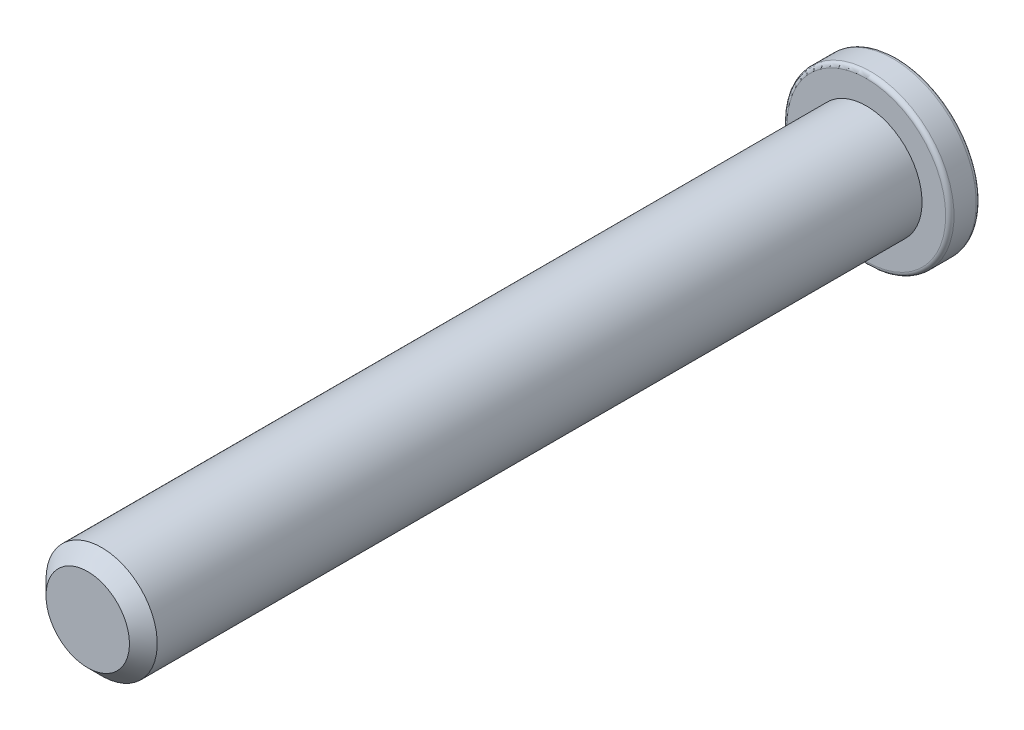
ISO-10303-21;
HEADER;
FILE_DESCRIPTION(('STEP AP214'),'2;1');
FILE_NAME('part.step','',(''),(''),'','','');
FILE_SCHEMA(('AUTOMOTIVE_DESIGN { 1 0 10303 214 1 1 1 1 }'));
ENDSEC;
DATA;
#1=APPLICATION_CONTEXT('core data for automotive mechanical design processes');
#2=APPLICATION_PROTOCOL_DEFINITION('international standard','automotive_design',2000,#1);
#3=PRODUCT_CONTEXT('',#1,'mechanical');
#4=PRODUCT('Part','Part','',(#3));
#5=PRODUCT_RELATED_PRODUCT_CATEGORY('part','',(#4));
#6=PRODUCT_DEFINITION_FORMATION('','',#4);
#7=PRODUCT_DEFINITION_CONTEXT('part definition',#1,'design');
#8=PRODUCT_DEFINITION('design','',#6,#7);
#9=PRODUCT_DEFINITION_SHAPE('','',#8);
#10=(LENGTH_UNIT() NAMED_UNIT(*) SI_UNIT(.MILLI.,.METRE.));
#11=(NAMED_UNIT(*) PLANE_ANGLE_UNIT() SI_UNIT($,.RADIAN.));
#12=(NAMED_UNIT(*) SI_UNIT($,.STERADIAN.) SOLID_ANGLE_UNIT());
#13=UNCERTAINTY_MEASURE_WITH_UNIT(LENGTH_MEASURE(1.E-05),#10,'distance_accuracy_value','');
#14=(GEOMETRIC_REPRESENTATION_CONTEXT(3) GLOBAL_UNCERTAINTY_ASSIGNED_CONTEXT((#13)) GLOBAL_UNIT_ASSIGNED_CONTEXT((#10,
#11,#12)) REPRESENTATION_CONTEXT('',''));
#15=CARTESIAN_POINT('',(0.,0.,0.));
#16=DIRECTION('',(0.,0.,1.));
#17=DIRECTION('',(1.,0.,0.));
#18=AXIS2_PLACEMENT_3D('',#15,#16,#17);
#19=CARTESIAN_POINT('',(-10.40000072,11.25,-18.9584026755113));
#20=DIRECTION('',(-0.923879532511287,0.,-0.38268343236509));
#21=DIRECTION('',(-0.38268343236509,0.,0.923879532511287));
#22=AXIS2_PLACEMENT_3D('',#19,#20,#21);
#23=PLANE('',#22);
#24=DIRECTION('',(0.,1.,0.));
#25=VECTOR('',#24,1.);
#26=CARTESIAN_POINT('',(-10.8970569948477,11.25,-17.7584026755113));
#27=LINE('',#26,#25);
#28=CARTESIAN_POINT('',(-10.8970569948477,11.1339121743322,-17.7584026755113));
#29=VERTEX_POINT('',#28);
#30=CARTESIAN_POINT('',(-10.8970569948477,11.3660878256678,-17.7584026755113));
#31=VERTEX_POINT('',#30);
#32=EDGE_CURVE('E117',#29,#31,#27,.T.);
#33=ORIENTED_EDGE('',*,*,#32,.T.);
#34=DIRECTION('',(-0.381887326256781,-0.0644695530821724,0.921957562347547));
#35=VECTOR('',#34,1.);
#36=CARTESIAN_POINT('',(-10.40000072,11.45,-18.9584026755113));
#37=LINE('',#36,#35);
#38=CARTESIAN_POINT('',(-10.40000072,11.45,-18.9584026755113));
#39=VERTEX_POINT('',#38);
#40=EDGE_CURVE('E133',#39,#31,#37,.T.);
#41=ORIENTED_EDGE('',*,*,#40,.F.);
#42=DIRECTION('',(0.,1.,0.));
#43=VECTOR('',#42,1.);
#44=CARTESIAN_POINT('',(-10.40000072,11.25,-18.9584026755113));
#45=LINE('',#44,#43);
#46=CARTESIAN_POINT('',(-10.40000072,11.05,-18.9584026755113));
#47=VERTEX_POINT('',#46);
#48=EDGE_CURVE('E122',#39,#47,#45,.F.);
#49=ORIENTED_EDGE('',*,*,#48,.T.);
#50=DIRECTION('',(0.381887326256781,-0.0644695530821737,-0.921957562347547));
#51=VECTOR('',#50,1.);
#52=CARTESIAN_POINT('',(-10.8970569948477,11.1339121743322,-17.7584026755113));
#53=LINE('',#52,#51);
#54=EDGE_CURVE('E286',#29,#47,#53,.T.);
#55=ORIENTED_EDGE('',*,*,#54,.F.);
#56=EDGE_LOOP('',(#33,#41,#49,#55));
#57=FACE_BOUND('',#56,.T.);
#58=ADVANCED_FACE('F17',(#57),#23,.T.);
#59=CARTESIAN_POINT('',(-11.25000072,11.45,-18.9584026755113));
#60=DIRECTION('',(0.,-0.997564050259824,-0.0697564737441253));
#61=DIRECTION('',(0.,0.0697564737441253,-0.997564050259824));
#62=AXIS2_PLACEMENT_3D('',#59,#60,#61);
#63=PLANE('',#62);
#64=DIRECTION('',(1.,0.,0.));
#65=VECTOR('',#64,1.);
#66=CARTESIAN_POINT('',(-11.25000072,11.3660878256678,-17.7584026755113));
#67=LINE('',#66,#65);
#68=CARTESIAN_POINT('',(-11.1339128943322,11.3660878256678,-17.7584026755113));
#69=VERTEX_POINT('',#68);
#70=EDGE_CURVE('E135',#31,#69,#67,.F.);
#71=ORIENTED_EDGE('',*,*,#70,.T.);
#72=DIRECTION('',(-0.0695873743166642,-0.0695873743166541,0.995145815783509));
#73=VECTOR('',#72,1.);
#74=CARTESIAN_POINT('',(-11.05000072,11.45,-18.9584026755113));
#75=LINE('',#74,#73);
#76=CARTESIAN_POINT('',(-11.05000072,11.45,-18.9584026755113));
#77=VERTEX_POINT('',#76);
#78=EDGE_CURVE('E139',#77,#69,#75,.T.);
#79=ORIENTED_EDGE('',*,*,#78,.F.);
#80=DIRECTION('',(1.,0.,0.));
#81=VECTOR('',#80,1.);
#82=CARTESIAN_POINT('',(-11.25000072,11.45,-18.9584026755113));
#83=LINE('',#82,#81);
#84=EDGE_CURVE('E126',#77,#39,#83,.T.);
#85=ORIENTED_EDGE('',*,*,#84,.T.);
#86=ORIENTED_EDGE('',*,*,#40,.T.);
#87=EDGE_LOOP('',(#71,#79,#85,#86));
#88=FACE_BOUND('',#87,.T.);
#89=ADVANCED_FACE('F137',(#88),#63,.T.);
#90=CARTESIAN_POINT('',(-11.25000072,11.05,-18.9584026755113));
#91=DIRECTION('',(0.,0.997564050259824,-0.0697564737441253));
#92=DIRECTION('',(0.,0.0697564737441253,0.997564050259824));
#93=AXIS2_PLACEMENT_3D('',#90,#91,#92);
#94=PLANE('',#93);
#95=DIRECTION('',(1.,0.,0.));
#96=VECTOR('',#95,1.);
#97=CARTESIAN_POINT('',(-11.25000072,11.1339121743322,-17.7584026755113));
#98=LINE('',#97,#96);
#99=CARTESIAN_POINT('',(-11.1339128943322,11.1339121743322,-17.7584026755113));
#100=VERTEX_POINT('',#99);
#101=EDGE_CURVE('E288',#100,#29,#98,.T.);
#102=ORIENTED_EDGE('',*,*,#101,.T.);
#103=ORIENTED_EDGE('',*,*,#54,.T.);
#104=DIRECTION('',(1.,0.,0.));
#105=VECTOR('',#104,1.);
#106=CARTESIAN_POINT('',(-11.25000072,11.05,-18.9584026755113));
#107=LINE('',#106,#105);
#108=CARTESIAN_POINT('',(-11.05000072,11.05,-18.9584026755113));
#109=VERTEX_POINT('',#108);
#110=EDGE_CURVE('E129',#47,#109,#107,.F.);
#111=ORIENTED_EDGE('',*,*,#110,.T.);
#112=DIRECTION('',(0.0695873743166642,-0.0695873743166541,-0.995145815783509));
#113=VECTOR('',#112,1.);
#114=CARTESIAN_POINT('',(-11.1339128943322,11.1339121743322,-17.7584026755113));
#115=LINE('',#114,#113);
#116=EDGE_CURVE('E272',#100,#109,#115,.T.);
#117=ORIENTED_EDGE('',*,*,#116,.F.);
#118=EDGE_LOOP('',(#102,#103,#111,#117));
#119=FACE_BOUND('',#118,.T.);
#120=ADVANCED_FACE('F459',(#119),#94,.T.);
#121=CARTESIAN_POINT('',(-11.05000072,11.25,-18.9584026755113));
#122=DIRECTION('',(-0.997564050259824,0.,-0.0697564737441253));
#123=DIRECTION('',(-0.0697564737441253,0.,0.997564050259824));
#124=AXIS2_PLACEMENT_3D('',#121,#122,#123);
#125=PLANE('',#124);
#126=DIRECTION('',(0.,1.,0.));
#127=VECTOR('',#126,1.);
#128=CARTESIAN_POINT('',(-11.1339128943322,11.25,-17.7584026755113));
#129=LINE('',#128,#127);
#130=CARTESIAN_POINT('',(-11.1339128943322,11.6029437251523,-17.7584026755113));
#131=VERTEX_POINT('',#130);
#132=EDGE_CURVE('E281',#69,#131,#129,.T.);
#133=ORIENTED_EDGE('',*,*,#132,.T.);
#134=DIRECTION('',(-0.0644695530821645,-0.381887326256792,0.921957562347544));
#135=VECTOR('',#134,1.);
#136=CARTESIAN_POINT('',(-11.05000072,12.1,-18.9584026755113));
#137=LINE('',#136,#135);
#138=CARTESIAN_POINT('',(-11.05000072,12.1,-18.9584026755113));
#139=VERTEX_POINT('',#138);
#140=EDGE_CURVE('E266',#139,#131,#137,.T.);
#141=ORIENTED_EDGE('',*,*,#140,.F.);
#142=DIRECTION('',(0.,1.,0.));
#143=VECTOR('',#142,1.);
#144=CARTESIAN_POINT('',(-11.05000072,11.25,-18.9584026755113));
#145=LINE('',#144,#143);
#146=EDGE_CURVE('E284',#139,#77,#145,.F.);
#147=ORIENTED_EDGE('',*,*,#146,.T.);
#148=ORIENTED_EDGE('',*,*,#78,.T.);
#149=EDGE_LOOP('',(#133,#141,#147,#148));
#150=FACE_BOUND('',#149,.T.);
#151=ADVANCED_FACE('F298',(#150),#125,.T.);
#152=CARTESIAN_POINT('',(-11.05000072,11.25,-18.9584026755113));
#153=DIRECTION('',(-0.997564050259824,0.,-0.0697564737441253));
#154=DIRECTION('',(-0.0697564737441253,0.,0.997564050259824));
#155=AXIS2_PLACEMENT_3D('',#152,#153,#154);
#156=PLANE('',#155);
#157=DIRECTION('',(0.,1.,0.));
#158=VECTOR('',#157,1.);
#159=CARTESIAN_POINT('',(-11.1339128943322,11.25,-17.7584026755113));
#160=LINE('',#159,#158);
#161=CARTESIAN_POINT('',(-11.1339128943322,10.8970562748477,-17.7584026755113));
#162=VERTEX_POINT('',#161);
#163=EDGE_CURVE('E275',#162,#100,#160,.T.);
#164=ORIENTED_EDGE('',*,*,#163,.T.);
#165=ORIENTED_EDGE('',*,*,#116,.T.);
#166=DIRECTION('',(0.,1.,0.));
#167=VECTOR('',#166,1.);
#168=CARTESIAN_POINT('',(-11.05000072,11.25,-18.9584026755113));
#169=LINE('',#168,#167);
#170=CARTESIAN_POINT('',(-11.05000072,10.4,-18.9584026755113));
#171=VERTEX_POINT('',#170);
#172=EDGE_CURVE('E278',#109,#171,#169,.F.);
#173=ORIENTED_EDGE('',*,*,#172,.T.);
#174=DIRECTION('',(0.0644695530821645,-0.381887326256792,-0.921957562347544));
#175=VECTOR('',#174,1.);
#176=CARTESIAN_POINT('',(-11.1339128943322,10.8970562748477,-17.7584026755113));
#177=LINE('',#176,#175);
#178=EDGE_CURVE('E255',#162,#171,#177,.T.);
#179=ORIENTED_EDGE('',*,*,#178,.F.);
#180=EDGE_LOOP('',(#164,#165,#173,#179));
#181=FACE_BOUND('',#180,.T.);
#182=ADVANCED_FACE('F445',(#181),#156,.T.);
#183=CARTESIAN_POINT('',(-11.25000072,12.1,-18.9584026755113));
#184=DIRECTION('',(0.,-0.923879532511287,-0.38268343236509));
#185=DIRECTION('',(0.,0.38268343236509,-0.923879532511287));
#186=AXIS2_PLACEMENT_3D('',#183,#184,#185);
#187=PLANE('',#186);
#188=DIRECTION('',(1.,0.,0.));
#189=VECTOR('',#188,1.);
#190=CARTESIAN_POINT('',(-11.25000072,11.6029437251523,-17.7584026755113));
#191=LINE('',#190,#189);
#192=CARTESIAN_POINT('',(-11.3660885456678,11.6029437251523,-17.7584026755113));
#193=VERTEX_POINT('',#192);
#194=EDGE_CURVE('E264',#131,#193,#191,.F.);
#195=ORIENTED_EDGE('',*,*,#194,.T.);
#196=DIRECTION('',(0.0644695530821724,-0.38188732625678,0.921957562347548));
#197=VECTOR('',#196,1.);
#198=CARTESIAN_POINT('',(-11.45000072,12.1,-18.9584026755113));
#199=LINE('',#198,#197);
#200=CARTESIAN_POINT('',(-11.45000072,12.1,-18.9584026755113));
#201=VERTEX_POINT('',#200);
#202=EDGE_CURVE('E249',#201,#193,#199,.T.);
#203=ORIENTED_EDGE('',*,*,#202,.F.);
#204=DIRECTION('',(1.,0.,0.));
#205=VECTOR('',#204,1.);
#206=CARTESIAN_POINT('',(-11.25000072,12.1,-18.9584026755113));
#207=LINE('',#206,#205);
#208=EDGE_CURVE('E269',#201,#139,#207,.T.);
#209=ORIENTED_EDGE('',*,*,#208,.T.);
#210=ORIENTED_EDGE('',*,*,#140,.T.);
#211=EDGE_LOOP('',(#195,#203,#209,#210));
#212=FACE_BOUND('',#211,.T.);
#213=ADVANCED_FACE('F302',(#212),#187,.T.);
#214=CARTESIAN_POINT('',(-11.25000072,10.4,-18.9584026755113));
#215=DIRECTION('',(0.,0.923879532511287,-0.38268343236509));
#216=DIRECTION('',(0.,0.38268343236509,0.923879532511287));
#217=AXIS2_PLACEMENT_3D('',#214,#215,#216);
#218=PLANE('',#217);
#219=DIRECTION('',(1.,0.,0.));
#220=VECTOR('',#219,1.);
#221=CARTESIAN_POINT('',(-11.25000072,10.8970562748477,-17.7584026755113));
#222=LINE('',#221,#220);
#223=CARTESIAN_POINT('',(-11.3660885456678,10.8970562748477,-17.7584026755113));
#224=VERTEX_POINT('',#223);
#225=EDGE_CURVE('E258',#224,#162,#222,.T.);
#226=ORIENTED_EDGE('',*,*,#225,.T.);
#227=ORIENTED_EDGE('',*,*,#178,.T.);
#228=DIRECTION('',(1.,0.,0.));
#229=VECTOR('',#228,1.);
#230=CARTESIAN_POINT('',(-11.25000072,10.4,-18.9584026755113));
#231=LINE('',#230,#229);
#232=CARTESIAN_POINT('',(-11.45000072,10.4,-18.9584026755113));
#233=VERTEX_POINT('',#232);
#234=EDGE_CURVE('E261',#171,#233,#231,.F.);
#235=ORIENTED_EDGE('',*,*,#234,.T.);
#236=DIRECTION('',(-0.0644695530821738,-0.381887326256779,-0.921957562347548));
#237=VECTOR('',#236,1.);
#238=CARTESIAN_POINT('',(-11.3660885456678,10.8970562748477,-17.7584026755113));
#239=LINE('',#238,#237);
#240=EDGE_CURVE('E241',#224,#233,#239,.T.);
#241=ORIENTED_EDGE('',*,*,#240,.F.);
#242=EDGE_LOOP('',(#226,#227,#235,#241));
#243=FACE_BOUND('',#242,.T.);
#244=ADVANCED_FACE('F431',(#243),#218,.T.);
#245=CARTESIAN_POINT('',(-11.45000072,11.25,-18.9584026755113));
#246=DIRECTION('',(0.997564050259824,0.,-0.0697564737441253));
#247=DIRECTION('',(-0.0697564737441253,0.,-0.997564050259824));
#248=AXIS2_PLACEMENT_3D('',#245,#246,#247);
#249=PLANE('',#248);
#250=DIRECTION('',(0.,1.,0.));
#251=VECTOR('',#250,1.);
#252=CARTESIAN_POINT('',(-11.3660885456678,11.25,-17.7584026755113));
#253=LINE('',#252,#251);
#254=CARTESIAN_POINT('',(-11.3660885456678,11.3660878256678,-17.7584026755113));
#255=VERTEX_POINT('',#254);
#256=EDGE_CURVE('E247',#193,#255,#253,.F.);
#257=ORIENTED_EDGE('',*,*,#256,.T.);
#258=DIRECTION('',(0.0695873743166541,-0.0695873743166642,0.995145815783509));
#259=VECTOR('',#258,1.);
#260=CARTESIAN_POINT('',(-11.45000072,11.45,-18.9584026755113));
#261=LINE('',#260,#259);
#262=CARTESIAN_POINT('',(-11.45000072,11.45,-18.9584026755113));
#263=VERTEX_POINT('',#262);
#264=EDGE_CURVE('E235',#263,#255,#261,.T.);
#265=ORIENTED_EDGE('',*,*,#264,.F.);
#266=DIRECTION('',(0.,1.,0.));
#267=VECTOR('',#266,1.);
#268=CARTESIAN_POINT('',(-11.45000072,11.25,-18.9584026755113));
#269=LINE('',#268,#267);
#270=EDGE_CURVE('E252',#263,#201,#269,.T.);
#271=ORIENTED_EDGE('',*,*,#270,.T.);
#272=ORIENTED_EDGE('',*,*,#202,.T.);
#273=EDGE_LOOP('',(#257,#265,#271,#272));
#274=FACE_BOUND('',#273,.T.);
#275=ADVANCED_FACE('F304',(#274),#249,.T.);
#276=CARTESIAN_POINT('',(-11.45000072,11.25,-18.9584026755113));
#277=DIRECTION('',(0.997564050259824,0.,-0.0697564737441253));
#278=DIRECTION('',(-0.0697564737441253,0.,-0.997564050259824));
#279=AXIS2_PLACEMENT_3D('',#276,#277,#278);
#280=PLANE('',#279);
#281=DIRECTION('',(0.,1.,0.));
#282=VECTOR('',#281,1.);
#283=CARTESIAN_POINT('',(-11.3660885456678,11.25,-17.7584026755113));
#284=LINE('',#283,#282);
#285=CARTESIAN_POINT('',(-11.3660885456678,11.1339121743322,-17.7584026755113));
#286=VERTEX_POINT('',#285);
#287=EDGE_CURVE('E230',#224,#286,#284,.T.);
#288=ORIENTED_EDGE('',*,*,#287,.F.);
#289=ORIENTED_EDGE('',*,*,#240,.T.);
#290=DIRECTION('',(0.,1.,0.));
#291=VECTOR('',#290,1.);
#292=CARTESIAN_POINT('',(-11.45000072,11.25,-18.9584026755113));
#293=LINE('',#292,#291);
#294=CARTESIAN_POINT('',(-11.45000072,11.05,-18.9584026755113));
#295=VERTEX_POINT('',#294);
#296=EDGE_CURVE('E244',#233,#295,#293,.T.);
#297=ORIENTED_EDGE('',*,*,#296,.T.);
#298=DIRECTION('',(-0.0695873743166541,-0.0695873743166642,-0.995145815783509));
#299=VECTOR('',#298,1.);
#300=CARTESIAN_POINT('',(-11.3660885456678,11.1339121743322,-17.7584026755113));
#301=LINE('',#300,#299);
#302=EDGE_CURVE('E222',#286,#295,#301,.T.);
#303=ORIENTED_EDGE('',*,*,#302,.F.);
#304=EDGE_LOOP('',(#288,#289,#297,#303));
#305=FACE_BOUND('',#304,.T.);
#306=ADVANCED_FACE('F417',(#305),#280,.T.);
#307=CARTESIAN_POINT('',(-11.25000072,11.45,-18.9584026755113));
#308=DIRECTION('',(0.,-0.997564050259824,-0.0697564737441253));
#309=DIRECTION('',(0.,0.0697564737441253,-0.997564050259824));
#310=AXIS2_PLACEMENT_3D('',#307,#308,#309);
#311=PLANE('',#310);
#312=DIRECTION('',(-1.,0.,0.));
#313=VECTOR('',#312,1.);
#314=CARTESIAN_POINT('',(-11.25000072,11.3660878256678,-17.7584026755113));
#315=LINE('',#314,#313);
#316=CARTESIAN_POINT('',(-11.6029444451523,11.3660878256678,-17.7584026755113));
#317=VERTEX_POINT('',#316);
#318=EDGE_CURVE('E232',#317,#255,#315,.F.);
#319=ORIENTED_EDGE('',*,*,#318,.F.);
#320=DIRECTION('',(0.381887326256792,-0.0644695530821645,0.921957562347544));
#321=VECTOR('',#320,1.);
#322=CARTESIAN_POINT('',(-12.10000072,11.45,-18.9584026755113));
#323=LINE('',#322,#321);
#324=CARTESIAN_POINT('',(-12.10000072,11.45,-18.9584026755113));
#325=VERTEX_POINT('',#324);
#326=EDGE_CURVE('E219',#325,#317,#323,.T.);
#327=ORIENTED_EDGE('',*,*,#326,.F.);
#328=DIRECTION('',(1.,0.,0.));
#329=VECTOR('',#328,1.);
#330=CARTESIAN_POINT('',(-11.25000072,11.45,-18.9584026755113));
#331=LINE('',#330,#329);
#332=EDGE_CURVE('E238',#325,#263,#331,.T.);
#333=ORIENTED_EDGE('',*,*,#332,.T.);
#334=ORIENTED_EDGE('',*,*,#264,.T.);
#335=EDGE_LOOP('',(#319,#327,#333,#334));
#336=FACE_BOUND('',#335,.T.);
#337=ADVANCED_FACE('F307',(#336),#311,.T.);
#338=CARTESIAN_POINT('',(-11.25000072,11.25,-17.7584026755113));
#339=DIRECTION('',(0.,0.,-1.));
#340=DIRECTION('',(-1.,0.,0.));
#341=AXIS2_PLACEMENT_3D('',#338,#339,#340);
#342=PLANE('',#341);
#343=ORIENTED_EDGE('',*,*,#225,.F.);
#344=ORIENTED_EDGE('',*,*,#287,.T.);
#345=DIRECTION('',(1.,0.,0.));
#346=VECTOR('',#345,1.);
#347=CARTESIAN_POINT('',(-11.25000072,11.1339121743322,-17.7584026755113));
#348=LINE('',#347,#346);
#349=CARTESIAN_POINT('',(-11.6029444451523,11.1339121743322,-17.7584026755113));
#350=VERTEX_POINT('',#349);
#351=EDGE_CURVE('E225',#350,#286,#348,.T.);
#352=ORIENTED_EDGE('',*,*,#351,.F.);
#353=DIRECTION('',(0.,1.,0.));
#354=VECTOR('',#353,1.);
#355=CARTESIAN_POINT('',(-11.6029444451523,11.25,-17.7584026755113));
#356=LINE('',#355,#354);
#357=EDGE_CURVE('E216',#317,#350,#356,.F.);
#358=ORIENTED_EDGE('',*,*,#357,.F.);
#359=ORIENTED_EDGE('',*,*,#318,.T.);
#360=ORIENTED_EDGE('',*,*,#256,.F.);
#361=ORIENTED_EDGE('',*,*,#194,.F.);
#362=ORIENTED_EDGE('',*,*,#132,.F.);
#363=ORIENTED_EDGE('',*,*,#70,.F.);
#364=ORIENTED_EDGE('',*,*,#32,.F.);
#365=ORIENTED_EDGE('',*,*,#101,.F.);
#366=ORIENTED_EDGE('',*,*,#163,.F.);
#367=EDGE_LOOP('',(#343,#344,#352,#358,#359,#360,#361,#362,#363,#364,#365,#366));
#368=FACE_BOUND('',#367,.T.);
#369=ADVANCED_FACE('F294',(#368),#342,.T.);
#370=CARTESIAN_POINT('',(-11.25000072,11.05,-18.9584026755113));
#371=DIRECTION('',(0.,0.997564050259824,-0.0697564737441253));
#372=DIRECTION('',(0.,0.0697564737441253,0.997564050259824));
#373=AXIS2_PLACEMENT_3D('',#370,#371,#372);
#374=PLANE('',#373);
#375=ORIENTED_EDGE('',*,*,#351,.T.);
#376=ORIENTED_EDGE('',*,*,#302,.T.);
#377=DIRECTION('',(1.,0.,0.));
#378=VECTOR('',#377,1.);
#379=CARTESIAN_POINT('',(-11.25000072,11.05,-18.9584026755113));
#380=LINE('',#379,#378);
#381=CARTESIAN_POINT('',(-12.10000072,11.05,-18.9584026755113));
#382=VERTEX_POINT('',#381);
#383=EDGE_CURVE('E228',#295,#382,#380,.F.);
#384=ORIENTED_EDGE('',*,*,#383,.T.);
#385=DIRECTION('',(-0.381887326256792,-0.0644695530821645,-0.921957562347544));
#386=VECTOR('',#385,1.);
#387=CARTESIAN_POINT('',(-11.6029444451523,11.1339121743322,-17.7584026755113));
#388=LINE('',#387,#386);
#389=EDGE_CURVE('E207',#350,#382,#388,.T.);
#390=ORIENTED_EDGE('',*,*,#389,.F.);
#391=EDGE_LOOP('',(#375,#376,#384,#390));
#392=FACE_BOUND('',#391,.T.);
#393=ADVANCED_FACE('F336',(#392),#374,.T.);
#394=CARTESIAN_POINT('',(-12.10000072,11.25,-18.9584026755113));
#395=DIRECTION('',(0.923879532511287,0.,-0.38268343236509));
#396=DIRECTION('',(-0.38268343236509,0.,-0.923879532511287));
#397=AXIS2_PLACEMENT_3D('',#394,#395,#396);
#398=PLANE('',#397);
#399=ORIENTED_EDGE('',*,*,#357,.T.);
#400=ORIENTED_EDGE('',*,*,#389,.T.);
#401=DIRECTION('',(0.,1.,0.));
#402=VECTOR('',#401,1.);
#403=CARTESIAN_POINT('',(-12.10000072,11.25,-18.9584026755113));
#404=LINE('',#403,#402);
#405=EDGE_CURVE('E215',#382,#325,#404,.T.);
#406=ORIENTED_EDGE('',*,*,#405,.T.);
#407=ORIENTED_EDGE('',*,*,#326,.T.);
#408=EDGE_LOOP('',(#399,#400,#406,#407));
#409=FACE_BOUND('',#408,.T.);
#410=ADVANCED_FACE('F331',(#409),#398,.T.);
#411=CARTESIAN_POINT('',(-11.25000072,11.25,-18.9584026755113));
#412=DIRECTION('',(0.,0.,1.));
#413=DIRECTION('',(1.,0.,0.));
#414=AXIS2_PLACEMENT_3D('',#411,#412,#413);
#415=PLANE('',#414);
#416=ORIENTED_EDGE('',*,*,#383,.F.);
#417=ORIENTED_EDGE('',*,*,#296,.F.);
#418=ORIENTED_EDGE('',*,*,#234,.F.);
#419=ORIENTED_EDGE('',*,*,#172,.F.);
#420=ORIENTED_EDGE('',*,*,#110,.F.);
#421=ORIENTED_EDGE('',*,*,#48,.F.);
#422=ORIENTED_EDGE('',*,*,#84,.F.);
#423=ORIENTED_EDGE('',*,*,#146,.F.);
#424=ORIENTED_EDGE('',*,*,#208,.F.);
#425=ORIENTED_EDGE('',*,*,#270,.F.);
#426=ORIENTED_EDGE('',*,*,#332,.F.);
#427=ORIENTED_EDGE('',*,*,#405,.F.);
#428=EDGE_LOOP('',(#416,#417,#418,#419,#420,#421,#422,#423,#424,#425,#426,#427));
#429=FACE_BOUND('',#428,.T.);
#430=CARTESIAN_POINT('',(-11.25000072,11.25,-18.9584026755113));
#431=DIRECTION('',(0.,0.,1.));
#432=DIRECTION('',(-1.,0.,0.));
#433=AXIS2_PLACEMENT_3D('',#430,#431,#432);
#434=CIRCLE('',#433,1.425);
#435=CARTESIAN_POINT('',(-12.67500072,11.25,-18.9584026755113));
#436=VERTEX_POINT('',#435);
#437=CARTESIAN_POINT('',(-9.82500072,11.25,-18.9584026755113));
#438=VERTEX_POINT('',#437);
#439=EDGE_CURVE('E311',#436,#438,#434,.T.);
#440=ORIENTED_EDGE('',*,*,#439,.F.);
#441=CARTESIAN_POINT('',(-11.25000072,11.25,-18.9584026755113));
#442=DIRECTION('',(0.,0.,1.));
#443=DIRECTION('',(1.,0.,0.));
#444=AXIS2_PLACEMENT_3D('',#441,#442,#443);
#445=CIRCLE('',#444,1.425);
#446=EDGE_CURVE('E187',#438,#436,#445,.T.);
#447=ORIENTED_EDGE('',*,*,#446,.F.);
#448=EDGE_LOOP('',(#440,#447));
#449=FACE_BOUND('',#448,.T.);
#450=ADVANCED_FACE('F123',(#429,#449),#415,.F.);
#451=CARTESIAN_POINT('',(-11.25000072,11.25,-18.8834026755113));
#452=DIRECTION('',(0.,0.,1.));
#453=DIRECTION('',(-1.,0.,0.));
#454=AXIS2_PLACEMENT_3D('',#451,#452,#453);
#455=TOROIDAL_SURFACE('',#454,1.425,0.075);
#456=CARTESIAN_POINT('',(-11.25000072,11.25,-18.8834026755113));
#457=DIRECTION('',(0.,0.,-1.));
#458=DIRECTION('',(-1.,0.,0.));
#459=AXIS2_PLACEMENT_3D('',#456,#457,#458);
#460=CIRCLE('',#459,1.5);
#461=CARTESIAN_POINT('',(-12.75000072,11.25,-18.8834026755113));
#462=VERTEX_POINT('',#461);
#463=EDGE_CURVE('E184',#462,#462,#460,.F.);
#464=ORIENTED_EDGE('',*,*,#463,.F.);
#465=EDGE_LOOP('',(#464));
#466=FACE_BOUND('',#465,.T.);
#467=ORIENTED_EDGE('',*,*,#446,.T.);
#468=ORIENTED_EDGE('',*,*,#439,.T.);
#469=EDGE_LOOP('',(#467,#468));
#470=FACE_BOUND('',#469,.T.);
#471=ADVANCED_FACE('F191',(#466,#470),#455,.T.);
#472=CARTESIAN_POINT('',(-11.25000072,11.25,-18.4084026755113));
#473=DIRECTION('',(0.,0.,-1.));
#474=DIRECTION('',(-1.,0.,0.));
#475=AXIS2_PLACEMENT_3D('',#472,#473,#474);
#476=CYLINDRICAL_SURFACE('',#475,1.5);
#477=ORIENTED_EDGE('',*,*,#463,.T.);
#478=EDGE_LOOP('',(#477));
#479=FACE_BOUND('',#478,.T.);
#480=CARTESIAN_POINT('',(-11.25000072,11.25,-18.4834026755113));
#481=DIRECTION('',(0.,0.,1.));
#482=DIRECTION('',(-1.,0.,0.));
#483=AXIS2_PLACEMENT_3D('',#480,#481,#482);
#484=CIRCLE('',#483,1.5);
#485=CARTESIAN_POINT('',(-12.75000072,11.25,-18.4834026755113));
#486=VERTEX_POINT('',#485);
#487=EDGE_CURVE('E149',#486,#486,#484,.T.);
#488=ORIENTED_EDGE('',*,*,#487,.F.);
#489=EDGE_LOOP('',(#488));
#490=FACE_BOUND('',#489,.T.);
#491=ADVANCED_FACE('F195',(#479,#490),#476,.T.);
#492=CARTESIAN_POINT('',(-11.25000072,11.25,-4.40840267551127));
#493=DIRECTION('',(0.,0.,1.));
#494=DIRECTION('',(1.,0.,0.));
#495=AXIS2_PLACEMENT_3D('',#492,#493,#494);
#496=PLANE('',#495);
#497=CARTESIAN_POINT('',(-11.25000072,11.25,-4.40840267555132));
#498=DIRECTION('',(0.,0.,-1.));
#499=DIRECTION('',(-1.,0.,0.));
#500=AXIS2_PLACEMENT_3D('',#497,#498,#499);
#501=CIRCLE('',#500,0.749999999985332);
#502=CARTESIAN_POINT('',(-12.0000007199853,11.25,-4.40840267555132));
#503=VERTEX_POINT('',#502);
#504=EDGE_CURVE('E145',#503,#503,#501,.T.);
#505=ORIENTED_EDGE('',*,*,#504,.F.);
#506=EDGE_LOOP('',(#505));
#507=FACE_BOUND('',#506,.T.);
#508=ADVANCED_FACE('F166',(#507),#496,.T.);
#509=CARTESIAN_POINT('',(-11.25000072,11.25,-18.4834026755113));
#510=DIRECTION('',(0.,0.,1.));
#511=DIRECTION('',(-1.,0.,0.));
#512=AXIS2_PLACEMENT_3D('',#509,#510,#511);
#513=TOROIDAL_SURFACE('',#512,1.425,0.075);
#514=CARTESIAN_POINT('',(-11.25000072,11.25,-18.4084026755113));
#515=DIRECTION('',(0.,0.,-1.));
#516=DIRECTION('',(1.,0.,0.));
#517=AXIS2_PLACEMENT_3D('',#514,#515,#516);
#518=CIRCLE('',#517,1.425);
#519=CARTESIAN_POINT('',(-12.67500072,11.25,-18.4084026755113));
#520=VERTEX_POINT('',#519);
#521=CARTESIAN_POINT('',(-9.82500072,11.25,-18.4084026755113));
#522=VERTEX_POINT('',#521);
#523=EDGE_CURVE('E148',#520,#522,#518,.F.);
#524=ORIENTED_EDGE('',*,*,#523,.F.);
#525=CARTESIAN_POINT('',(-11.25000072,11.25,-18.4084026755113));
#526=DIRECTION('',(0.,0.,-1.));
#527=DIRECTION('',(-1.,0.,0.));
#528=AXIS2_PLACEMENT_3D('',#525,#526,#527);
#529=CIRCLE('',#528,1.425);
#530=EDGE_CURVE('E36',#522,#520,#529,.F.);
#531=ORIENTED_EDGE('',*,*,#530,.F.);
#532=EDGE_LOOP('',(#524,#531));
#533=FACE_BOUND('',#532,.T.);
#534=ORIENTED_EDGE('',*,*,#487,.T.);
#535=EDGE_LOOP('',(#534));
#536=FACE_BOUND('',#535,.T.);
#537=ADVANCED_FACE('F154',(#533,#536),#513,.T.);
#538=CARTESIAN_POINT('',(-11.25000072,11.25,-4.65840267577278));
#539=DIRECTION('',(0.,0.,-1.));
#540=DIRECTION('',(-1.,0.,0.));
#541=AXIS2_PLACEMENT_3D('',#538,#539,#540);
#542=CONICAL_SURFACE('',#541,0.999999999752046,0.785398162487954);
#543=ORIENTED_EDGE('',*,*,#504,.T.);
#544=EDGE_LOOP('',(#543));
#545=FACE_BOUND('',#544,.T.);
#546=CARTESIAN_POINT('',(-11.25000072,11.25,-4.65840267551127));
#547=DIRECTION('',(0.,0.,-1.));
#548=DIRECTION('',(-1.,0.,0.));
#549=AXIS2_PLACEMENT_3D('',#546,#547,#548);
#550=CIRCLE('',#549,1.);
#551=CARTESIAN_POINT('',(-12.25000072,11.25,-4.65840267551127));
#552=VERTEX_POINT('',#551);
#553=EDGE_CURVE('E28',#552,#552,#550,.T.);
#554=ORIENTED_EDGE('',*,*,#553,.F.);
#555=EDGE_LOOP('',(#554));
#556=FACE_BOUND('',#555,.T.);
#557=ADVANCED_FACE('F165',(#545,#556),#542,.T.);
#558=CARTESIAN_POINT('',(-11.25000072,11.25,-18.4084026755113));
#559=DIRECTION('',(0.,0.,1.));
#560=DIRECTION('',(1.,0.,0.));
#561=AXIS2_PLACEMENT_3D('',#558,#559,#560);
#562=PLANE('',#561);
#563=CARTESIAN_POINT('',(-11.25000072,11.25,-18.4084026755113));
#564=DIRECTION('',(0.,0.,-1.));
#565=DIRECTION('',(-1.,0.,0.));
#566=AXIS2_PLACEMENT_3D('',#563,#564,#565);
#567=CIRCLE('',#566,1.);
#568=CARTESIAN_POINT('',(-12.25000072,11.25,-18.4084026755113));
#569=VERTEX_POINT('',#568);
#570=EDGE_CURVE('E11',#569,#569,#567,.F.);
#571=ORIENTED_EDGE('',*,*,#570,.F.);
#572=EDGE_LOOP('',(#571));
#573=FACE_BOUND('',#572,.T.);
#574=ORIENTED_EDGE('',*,*,#523,.T.);
#575=ORIENTED_EDGE('',*,*,#530,.T.);
#576=EDGE_LOOP('',(#574,#575));
#577=FACE_BOUND('',#576,.T.);
#578=ADVANCED_FACE('F339',(#573,#577),#562,.T.);
#579=CARTESIAN_POINT('',(-11.25000072,11.25,-4.40840267551127));
#580=DIRECTION('',(0.,0.,-1.));
#581=DIRECTION('',(-1.,0.,0.));
#582=AXIS2_PLACEMENT_3D('',#579,#580,#581);
#583=CYLINDRICAL_SURFACE('',#582,1.);
#584=ORIENTED_EDGE('',*,*,#553,.T.);
#585=EDGE_LOOP('',(#584));
#586=FACE_BOUND('',#585,.T.);
#587=ORIENTED_EDGE('',*,*,#570,.T.);
#588=EDGE_LOOP('',(#587));
#589=FACE_BOUND('',#588,.T.);
#590=ADVANCED_FACE('F337',(#586,#589),#583,.T.);
#591=CLOSED_SHELL('',(#58,#89,#120,#151,#182,#213,#244,#275,#306,#337,#369,#393,#410,#450,#471,
#491,#508,#537,#557,#578,#590));
#592=MANIFOLD_SOLID_BREP('B1',#591);
#593=ADVANCED_BREP_SHAPE_REPRESENTATION('',(#18,#592),#14);
#594=SHAPE_DEFINITION_REPRESENTATION(#9,#593);
ENDSEC;
END-ISO-10303-21;
